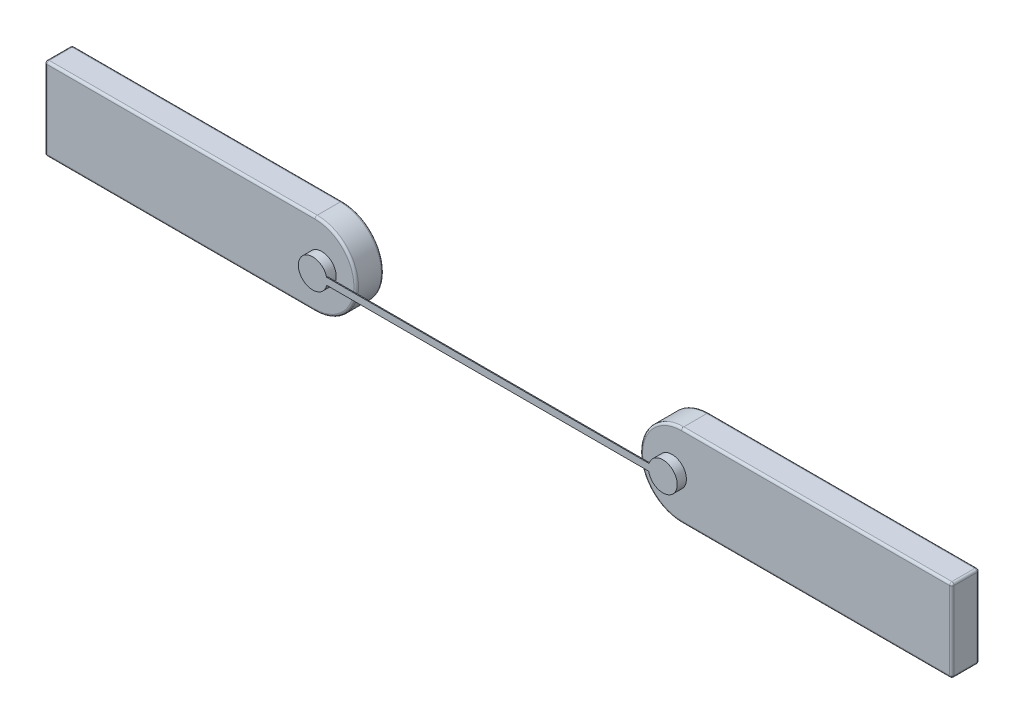
ISO-10303-21;
HEADER;
FILE_DESCRIPTION(('STEP AP214'),'2;1');
FILE_NAME('part.step','',(''),(''),'','','');
FILE_SCHEMA(('AUTOMOTIVE_DESIGN { 1 0 10303 214 1 1 1 1 }'));
ENDSEC;
DATA;
#1=APPLICATION_CONTEXT('core data for automotive mechanical design processes');
#2=APPLICATION_PROTOCOL_DEFINITION('international standard','automotive_design',2000,#1);
#3=PRODUCT_CONTEXT('',#1,'mechanical');
#4=PRODUCT('Part','Part','',(#3));
#5=PRODUCT_RELATED_PRODUCT_CATEGORY('part','',(#4));
#6=PRODUCT_DEFINITION_FORMATION('','',#4);
#7=PRODUCT_DEFINITION_CONTEXT('part definition',#1,'design');
#8=PRODUCT_DEFINITION('design','',#6,#7);
#9=PRODUCT_DEFINITION_SHAPE('','',#8);
#10=(LENGTH_UNIT() NAMED_UNIT(*) SI_UNIT(.MILLI.,.METRE.));
#11=(NAMED_UNIT(*) PLANE_ANGLE_UNIT() SI_UNIT($,.RADIAN.));
#12=(NAMED_UNIT(*) SI_UNIT($,.STERADIAN.) SOLID_ANGLE_UNIT());
#13=UNCERTAINTY_MEASURE_WITH_UNIT(LENGTH_MEASURE(1.E-05),#10,'distance_accuracy_value','');
#14=(GEOMETRIC_REPRESENTATION_CONTEXT(3) GLOBAL_UNCERTAINTY_ASSIGNED_CONTEXT((#13)) GLOBAL_UNIT_ASSIGNED_CONTEXT((#10,
#11,#12)) REPRESENTATION_CONTEXT('',''));
#15=CARTESIAN_POINT('',(0.,0.,0.));
#16=DIRECTION('',(0.,0.,1.));
#17=DIRECTION('',(1.,0.,0.));
#18=AXIS2_PLACEMENT_3D('',#15,#16,#17);
#19=CARTESIAN_POINT('',(-4.925,0.425,0.025));
#20=DIRECTION('',(1.,0.,0.));
#21=DIRECTION('',(0.,0.,-1.));
#22=AXIS2_PLACEMENT_3D('',#19,#20,#21);
#23=SPHERICAL_SURFACE('',#22,0.0250000000000003);
#24=CARTESIAN_POINT('',(-4.925,0.425,0.025));
#25=DIRECTION('',(-1.,0.,0.));
#26=DIRECTION('',(0.,0.,1.));
#27=AXIS2_PLACEMENT_3D('',#24,#25,#26);
#28=CIRCLE('',#27,0.025);
#29=CARTESIAN_POINT('',(-4.925,0.425,0.));
#30=VERTEX_POINT('',#29);
#31=CARTESIAN_POINT('',(-4.925,0.45,0.025));
#32=VERTEX_POINT('',#31);
#33=EDGE_CURVE('E109',#30,#32,#28,.F.);
#34=ORIENTED_EDGE('',*,*,#33,.F.);
#35=CARTESIAN_POINT('',(-4.925,0.425,0.025));
#36=DIRECTION('',(0.,-1.,0.));
#37=DIRECTION('',(0.,0.,-1.));
#38=AXIS2_PLACEMENT_3D('',#35,#36,#37);
#39=CIRCLE('',#38,0.025);
#40=CARTESIAN_POINT('',(-4.95,0.425,0.025));
#41=VERTEX_POINT('',#40);
#42=EDGE_CURVE('E113',#41,#30,#39,.T.);
#43=ORIENTED_EDGE('',*,*,#42,.F.);
#44=CARTESIAN_POINT('',(-4.925,0.425,0.025));
#45=DIRECTION('',(0.,0.,-1.));
#46=DIRECTION('',(-1.,0.,0.));
#47=AXIS2_PLACEMENT_3D('',#44,#45,#46);
#48=CIRCLE('',#47,0.025);
#49=EDGE_CURVE('E137',#32,#41,#48,.F.);
#50=ORIENTED_EDGE('',*,*,#49,.F.);
#51=EDGE_LOOP('',(#34,#43,#50));
#52=FACE_BOUND('',#51,.T.);
#53=ADVANCED_FACE('F17',(#52),#23,.T.);
#54=CARTESIAN_POINT('',(-3.338292000825,0.,0.));
#55=DIRECTION('',(0.,0.,1.));
#56=DIRECTION('',(1.,0.,0.));
#57=AXIS2_PLACEMENT_3D('',#54,#55,#56);
#58=PLANE('',#57);
#59=CARTESIAN_POINT('',(-2.,0.,0.));
#60=DIRECTION('',(0.,0.,1.));
#61=DIRECTION('',(1.,0.,0.));
#62=AXIS2_PLACEMENT_3D('',#59,#60,#61);
#63=CIRCLE('',#62,0.425);
#64=CARTESIAN_POINT('',(-2.,-0.425,0.));
#65=VERTEX_POINT('',#64);
#66=CARTESIAN_POINT('',(-2.,0.425,0.));
#67=VERTEX_POINT('',#66);
#68=EDGE_CURVE('E21',#65,#67,#63,.T.);
#69=ORIENTED_EDGE('',*,*,#68,.F.);
#70=DIRECTION('',(1.,0.,0.));
#71=VECTOR('',#70,1.);
#72=CARTESIAN_POINT('',(-3.406646000412,-0.425,0.));
#73=LINE('',#72,#71);
#74=CARTESIAN_POINT('',(-4.925,-0.425,0.));
#75=VERTEX_POINT('',#74);
#76=EDGE_CURVE('E120',#75,#65,#73,.T.);
#77=ORIENTED_EDGE('',*,*,#76,.F.);
#78=DIRECTION('',(0.,-1.,0.));
#79=VECTOR('',#78,1.);
#80=CARTESIAN_POINT('',(-4.925,0.,0.));
#81=LINE('',#80,#79);
#82=EDGE_CURVE('E116',#30,#75,#81,.T.);
#83=ORIENTED_EDGE('',*,*,#82,.F.);
#84=DIRECTION('',(-1.,0.,0.));
#85=VECTOR('',#84,1.);
#86=CARTESIAN_POINT('',(-3.406646000412,0.425,0.));
#87=LINE('',#86,#85);
#88=EDGE_CURVE('E103',#67,#30,#87,.T.);
#89=ORIENTED_EDGE('',*,*,#88,.F.);
#90=EDGE_LOOP('',(#69,#77,#83,#89));
#91=FACE_BOUND('',#90,.T.);
#92=ADVANCED_FACE('F118',(#91),#58,.F.);
#93=CARTESIAN_POINT('',(-4.925,-0.425,0.025));
#94=DIRECTION('',(1.,0.,0.));
#95=DIRECTION('',(0.,-1.,0.));
#96=AXIS2_PLACEMENT_3D('',#93,#94,#95);
#97=SPHERICAL_SURFACE('',#96,0.0250000000000004);
#98=CARTESIAN_POINT('',(-4.925,-0.425,0.025));
#99=DIRECTION('',(0.,-1.,0.));
#100=DIRECTION('',(0.,0.,-1.));
#101=AXIS2_PLACEMENT_3D('',#98,#99,#100);
#102=CIRCLE('',#101,0.025);
#103=CARTESIAN_POINT('',(-4.95,-0.425,0.025));
#104=VERTEX_POINT('',#103);
#105=EDGE_CURVE('E124',#75,#104,#102,.F.);
#106=ORIENTED_EDGE('',*,*,#105,.F.);
#107=CARTESIAN_POINT('',(-4.925,-0.425,0.025));
#108=DIRECTION('',(1.,0.,0.));
#109=DIRECTION('',(0.,0.,-1.));
#110=AXIS2_PLACEMENT_3D('',#107,#108,#109);
#111=CIRCLE('',#110,0.025);
#112=CARTESIAN_POINT('',(-4.925,-0.45,0.025));
#113=VERTEX_POINT('',#112);
#114=EDGE_CURVE('E148',#113,#75,#111,.T.);
#115=ORIENTED_EDGE('',*,*,#114,.F.);
#116=CARTESIAN_POINT('',(-4.925,-0.425,0.025));
#117=DIRECTION('',(0.,0.,-1.));
#118=DIRECTION('',(-1.,0.,0.));
#119=AXIS2_PLACEMENT_3D('',#116,#117,#118);
#120=CIRCLE('',#119,0.025);
#121=EDGE_CURVE('E286',#104,#113,#120,.F.);
#122=ORIENTED_EDGE('',*,*,#121,.F.);
#123=EDGE_LOOP('',(#106,#115,#122));
#124=FACE_BOUND('',#123,.T.);
#125=ADVANCED_FACE('F1074',(#124),#97,.T.);
#126=CARTESIAN_POINT('',(-2.,0.,0.025));
#127=DIRECTION('',(0.,0.,1.));
#128=DIRECTION('',(1.,0.,0.));
#129=AXIS2_PLACEMENT_3D('',#126,#127,#128);
#130=TOROIDAL_SURFACE('',#129,0.425,0.0249999999999998);
#131=ORIENTED_EDGE('',*,*,#68,.T.);
#132=CARTESIAN_POINT('',(-2.,0.425,0.025));
#133=DIRECTION('',(-1.,0.,0.));
#134=DIRECTION('',(0.,0.,1.));
#135=AXIS2_PLACEMENT_3D('',#132,#133,#134);
#136=CIRCLE('',#135,0.025);
#137=CARTESIAN_POINT('',(-2.,0.45,0.025));
#138=VERTEX_POINT('',#137);
#139=EDGE_CURVE('E111',#138,#67,#136,.T.);
#140=ORIENTED_EDGE('',*,*,#139,.F.);
#141=CARTESIAN_POINT('',(-2.,0.,0.025));
#142=DIRECTION('',(0.,0.,-1.));
#143=DIRECTION('',(-1.,0.,0.));
#144=AXIS2_PLACEMENT_3D('',#141,#142,#143);
#145=CIRCLE('',#144,0.45);
#146=CARTESIAN_POINT('',(-2.,-0.45,0.025));
#147=VERTEX_POINT('',#146);
#148=EDGE_CURVE('E289',#147,#138,#145,.F.);
#149=ORIENTED_EDGE('',*,*,#148,.F.);
#150=CARTESIAN_POINT('',(-2.,-0.425,0.025));
#151=DIRECTION('',(1.,0.,0.));
#152=DIRECTION('',(0.,0.,-1.));
#153=AXIS2_PLACEMENT_3D('',#150,#151,#152);
#154=CIRCLE('',#153,0.025);
#155=EDGE_CURVE('E147',#65,#147,#154,.F.);
#156=ORIENTED_EDGE('',*,*,#155,.F.);
#157=EDGE_LOOP('',(#131,#140,#149,#156));
#158=FACE_BOUND('',#157,.T.);
#159=ADVANCED_FACE('F1065',(#158),#130,.T.);
#160=CARTESIAN_POINT('',(-3.406646000412,0.425,0.025));
#161=DIRECTION('',(-1.,0.,0.));
#162=DIRECTION('',(0.,0.,1.));
#163=AXIS2_PLACEMENT_3D('',#160,#161,#162);
#164=CYLINDRICAL_SURFACE('',#163,0.025);
#165=ORIENTED_EDGE('',*,*,#139,.T.);
#166=ORIENTED_EDGE('',*,*,#88,.T.);
#167=ORIENTED_EDGE('',*,*,#33,.T.);
#168=DIRECTION('',(1.,0.,0.));
#169=VECTOR('',#168,1.);
#170=CARTESIAN_POINT('',(-3.475,0.45,0.025));
#171=LINE('',#170,#169);
#172=EDGE_CURVE('E283',#138,#32,#171,.F.);
#173=ORIENTED_EDGE('',*,*,#172,.F.);
#174=EDGE_LOOP('',(#165,#166,#167,#173));
#175=FACE_BOUND('',#174,.T.);
#176=ADVANCED_FACE('F105',(#175),#164,.T.);
#177=CARTESIAN_POINT('',(-4.925,0.,0.025));
#178=DIRECTION('',(0.,-1.,0.));
#179=DIRECTION('',(0.,0.,-1.));
#180=AXIS2_PLACEMENT_3D('',#177,#178,#179);
#181=CYLINDRICAL_SURFACE('',#180,0.025);
#182=ORIENTED_EDGE('',*,*,#105,.T.);
#183=DIRECTION('',(0.,1.,0.));
#184=VECTOR('',#183,1.);
#185=CARTESIAN_POINT('',(-4.95,0.,0.025));
#186=LINE('',#185,#184);
#187=EDGE_CURVE('E131',#41,#104,#186,.F.);
#188=ORIENTED_EDGE('',*,*,#187,.F.);
#189=ORIENTED_EDGE('',*,*,#42,.T.);
#190=ORIENTED_EDGE('',*,*,#82,.T.);
#191=EDGE_LOOP('',(#182,#188,#189,#190));
#192=FACE_BOUND('',#191,.T.);
#193=ADVANCED_FACE('F128',(#192),#181,.T.);
#194=CARTESIAN_POINT('',(-4.925,0.425,0.3));
#195=DIRECTION('',(0.,0.,-1.));
#196=DIRECTION('',(-1.,0.,0.));
#197=AXIS2_PLACEMENT_3D('',#194,#195,#196);
#198=CYLINDRICAL_SURFACE('',#197,0.025);
#199=ORIENTED_EDGE('',*,*,#49,.T.);
#200=DIRECTION('',(0.,0.,1.));
#201=VECTOR('',#200,1.);
#202=CARTESIAN_POINT('',(-4.95,0.425,0.3));
#203=LINE('',#202,#201);
#204=CARTESIAN_POINT('',(-4.95,0.425,0.275));
#205=VERTEX_POINT('',#204);
#206=EDGE_CURVE('E247',#205,#41,#203,.F.);
#207=ORIENTED_EDGE('',*,*,#206,.F.);
#208=CARTESIAN_POINT('',(-4.925,0.425,0.275));
#209=DIRECTION('',(0.,0.,1.));
#210=DIRECTION('',(1.,0.,0.));
#211=AXIS2_PLACEMENT_3D('',#208,#209,#210);
#212=CIRCLE('',#211,0.0250000000000004);
#213=CARTESIAN_POINT('',(-4.925,0.45,0.275));
#214=VERTEX_POINT('',#213);
#215=EDGE_CURVE('E262',#214,#205,#212,.T.);
#216=ORIENTED_EDGE('',*,*,#215,.F.);
#217=DIRECTION('',(0.,0.,1.));
#218=VECTOR('',#217,1.);
#219=CARTESIAN_POINT('',(-4.925,0.45,0.3));
#220=LINE('',#219,#218);
#221=EDGE_CURVE('E274',#32,#214,#220,.T.);
#222=ORIENTED_EDGE('',*,*,#221,.F.);
#223=EDGE_LOOP('',(#199,#207,#216,#222));
#224=FACE_BOUND('',#223,.T.);
#225=ADVANCED_FACE('F1038',(#224),#198,.T.);
#226=CARTESIAN_POINT('',(-3.406646000412,-0.425,0.025));
#227=DIRECTION('',(1.,0.,0.));
#228=DIRECTION('',(0.,0.,-1.));
#229=AXIS2_PLACEMENT_3D('',#226,#227,#228);
#230=CYLINDRICAL_SURFACE('',#229,0.025);
#231=ORIENTED_EDGE('',*,*,#155,.T.);
#232=DIRECTION('',(1.,0.,0.));
#233=VECTOR('',#232,1.);
#234=CARTESIAN_POINT('',(-3.475,-0.45,0.025));
#235=LINE('',#234,#233);
#236=EDGE_CURVE('E237',#113,#147,#235,.T.);
#237=ORIENTED_EDGE('',*,*,#236,.F.);
#238=ORIENTED_EDGE('',*,*,#114,.T.);
#239=ORIENTED_EDGE('',*,*,#76,.T.);
#240=EDGE_LOOP('',(#231,#237,#238,#239));
#241=FACE_BOUND('',#240,.T.);
#242=ADVANCED_FACE('F1028',(#241),#230,.T.);
#243=CARTESIAN_POINT('',(-4.925,-0.425,0.3));
#244=DIRECTION('',(0.,0.,-1.));
#245=DIRECTION('',(-1.,0.,0.));
#246=AXIS2_PLACEMENT_3D('',#243,#244,#245);
#247=CYLINDRICAL_SURFACE('',#246,0.025);
#248=ORIENTED_EDGE('',*,*,#121,.T.);
#249=DIRECTION('',(0.,0.,-1.));
#250=VECTOR('',#249,1.);
#251=CARTESIAN_POINT('',(-4.925,-0.45,0.3));
#252=LINE('',#251,#250);
#253=CARTESIAN_POINT('',(-4.925,-0.45,0.275));
#254=VERTEX_POINT('',#253);
#255=EDGE_CURVE('E236',#254,#113,#252,.T.);
#256=ORIENTED_EDGE('',*,*,#255,.F.);
#257=CARTESIAN_POINT('',(-4.925,-0.425,0.275));
#258=DIRECTION('',(0.,0.,1.));
#259=DIRECTION('',(1.,0.,0.));
#260=AXIS2_PLACEMENT_3D('',#257,#258,#259);
#261=CIRCLE('',#260,0.0250000000000004);
#262=CARTESIAN_POINT('',(-4.95,-0.425,0.275));
#263=VERTEX_POINT('',#262);
#264=EDGE_CURVE('E244',#263,#254,#261,.T.);
#265=ORIENTED_EDGE('',*,*,#264,.F.);
#266=DIRECTION('',(0.,0.,1.));
#267=VECTOR('',#266,1.);
#268=CARTESIAN_POINT('',(-4.95,-0.425,0.3));
#269=LINE('',#268,#267);
#270=EDGE_CURVE('E254',#104,#263,#269,.T.);
#271=ORIENTED_EDGE('',*,*,#270,.F.);
#272=EDGE_LOOP('',(#248,#256,#265,#271));
#273=FACE_BOUND('',#272,.T.);
#274=ADVANCED_FACE('F1019',(#273),#247,.T.);
#275=CARTESIAN_POINT('',(-2.,0.,0.3));
#276=DIRECTION('',(0.,0.,-1.));
#277=DIRECTION('',(-1.,0.,0.));
#278=AXIS2_PLACEMENT_3D('',#275,#276,#277);
#279=CYLINDRICAL_SURFACE('',#278,0.45);
#280=CARTESIAN_POINT('',(-2.,0.,0.275));
#281=DIRECTION('',(0.,0.,1.));
#282=DIRECTION('',(1.,0.,0.));
#283=AXIS2_PLACEMENT_3D('',#280,#281,#282);
#284=CIRCLE('',#283,0.45);
#285=CARTESIAN_POINT('',(-2.,-0.45,0.275));
#286=VERTEX_POINT('',#285);
#287=CARTESIAN_POINT('',(-2.,0.45,0.275));
#288=VERTEX_POINT('',#287);
#289=EDGE_CURVE('E228',#286,#288,#284,.T.);
#290=ORIENTED_EDGE('',*,*,#289,.F.);
#291=DIRECTION('',(0.,0.,-1.));
#292=VECTOR('',#291,1.);
#293=CARTESIAN_POINT('',(-2.,-0.45,0.3));
#294=LINE('',#293,#292);
#295=EDGE_CURVE('E233',#147,#286,#294,.F.);
#296=ORIENTED_EDGE('',*,*,#295,.F.);
#297=ORIENTED_EDGE('',*,*,#148,.T.);
#298=DIRECTION('',(0.,0.,1.));
#299=VECTOR('',#298,1.);
#300=CARTESIAN_POINT('',(-2.,0.45,0.3));
#301=LINE('',#300,#299);
#302=EDGE_CURVE('E265',#288,#138,#301,.F.);
#303=ORIENTED_EDGE('',*,*,#302,.F.);
#304=EDGE_LOOP('',(#290,#296,#297,#303));
#305=FACE_BOUND('',#304,.T.);
#306=ADVANCED_FACE('F1010',(#305),#279,.T.);
#307=CARTESIAN_POINT('',(-3.475,0.45,0.3));
#308=DIRECTION('',(0.,1.,0.));
#309=DIRECTION('',(0.,0.,1.));
#310=AXIS2_PLACEMENT_3D('',#307,#308,#309);
#311=PLANE('',#310);
#312=DIRECTION('',(-1.,0.,0.));
#313=VECTOR('',#312,1.);
#314=CARTESIAN_POINT('',(-3.406646000412,0.45,0.275));
#315=LINE('',#314,#313);
#316=EDGE_CURVE('E217',#288,#214,#315,.T.);
#317=ORIENTED_EDGE('',*,*,#316,.F.);
#318=ORIENTED_EDGE('',*,*,#302,.T.);
#319=ORIENTED_EDGE('',*,*,#172,.T.);
#320=ORIENTED_EDGE('',*,*,#221,.T.);
#321=EDGE_LOOP('',(#317,#318,#319,#320));
#322=FACE_BOUND('',#321,.T.);
#323=ADVANCED_FACE('F322',(#322),#311,.T.);
#324=CARTESIAN_POINT('',(-4.925,0.425,0.275));
#325=DIRECTION('',(1.,0.,0.));
#326=DIRECTION('',(0.,1.,0.));
#327=AXIS2_PLACEMENT_3D('',#324,#325,#326);
#328=SPHERICAL_SURFACE('',#327,0.0250000000000004);
#329=CARTESIAN_POINT('',(-4.925,0.425,0.275));
#330=DIRECTION('',(-1.,0.,0.));
#331=DIRECTION('',(0.,0.,1.));
#332=AXIS2_PLACEMENT_3D('',#329,#330,#331);
#333=CIRCLE('',#332,0.025);
#334=CARTESIAN_POINT('',(-4.925,0.425,0.3));
#335=VERTEX_POINT('',#334);
#336=EDGE_CURVE('E223',#214,#335,#333,.F.);
#337=ORIENTED_EDGE('',*,*,#336,.F.);
#338=ORIENTED_EDGE('',*,*,#215,.T.);
#339=CARTESIAN_POINT('',(-4.925,0.425,0.275));
#340=DIRECTION('',(0.,-1.,0.));
#341=DIRECTION('',(0.,0.,-1.));
#342=AXIS2_PLACEMENT_3D('',#339,#340,#341);
#343=CIRCLE('',#342,0.025);
#344=EDGE_CURVE('E214',#335,#205,#343,.T.);
#345=ORIENTED_EDGE('',*,*,#344,.F.);
#346=EDGE_LOOP('',(#337,#338,#345));
#347=FACE_BOUND('',#346,.T.);
#348=ADVANCED_FACE('F600',(#347),#328,.T.);
#349=CARTESIAN_POINT('',(-4.95,0.,0.3));
#350=DIRECTION('',(-1.,0.,0.));
#351=DIRECTION('',(0.,0.,1.));
#352=AXIS2_PLACEMENT_3D('',#349,#350,#351);
#353=PLANE('',#352);
#354=DIRECTION('',(0.,-1.,0.));
#355=VECTOR('',#354,1.);
#356=CARTESIAN_POINT('',(-4.95,0.,0.275));
#357=LINE('',#356,#355);
#358=EDGE_CURVE('E211',#205,#263,#357,.T.);
#359=ORIENTED_EDGE('',*,*,#358,.F.);
#360=ORIENTED_EDGE('',*,*,#206,.T.);
#361=ORIENTED_EDGE('',*,*,#187,.T.);
#362=ORIENTED_EDGE('',*,*,#270,.T.);
#363=EDGE_LOOP('',(#359,#360,#361,#362));
#364=FACE_BOUND('',#363,.T.);
#365=ADVANCED_FACE('F984',(#364),#353,.T.);
#366=CARTESIAN_POINT('',(-4.925,-0.425,0.275));
#367=DIRECTION('',(1.,0.,0.));
#368=DIRECTION('',(0.,0.,1.));
#369=AXIS2_PLACEMENT_3D('',#366,#367,#368);
#370=SPHERICAL_SURFACE('',#369,0.0250000000000003);
#371=ORIENTED_EDGE('',*,*,#264,.T.);
#372=CARTESIAN_POINT('',(-4.925,-0.425,0.275));
#373=DIRECTION('',(1.,0.,0.));
#374=DIRECTION('',(0.,0.,-1.));
#375=AXIS2_PLACEMENT_3D('',#372,#373,#374);
#376=CIRCLE('',#375,0.025);
#377=CARTESIAN_POINT('',(-4.925,-0.425,0.3));
#378=VERTEX_POINT('',#377);
#379=EDGE_CURVE('E190',#378,#254,#376,.T.);
#380=ORIENTED_EDGE('',*,*,#379,.F.);
#381=CARTESIAN_POINT('',(-4.925,-0.425,0.275));
#382=DIRECTION('',(0.,-1.,0.));
#383=DIRECTION('',(0.,0.,-1.));
#384=AXIS2_PLACEMENT_3D('',#381,#382,#383);
#385=CIRCLE('',#384,0.025);
#386=EDGE_CURVE('E200',#263,#378,#385,.F.);
#387=ORIENTED_EDGE('',*,*,#386,.F.);
#388=EDGE_LOOP('',(#371,#380,#387));
#389=FACE_BOUND('',#388,.T.);
#390=ADVANCED_FACE('F608',(#389),#370,.T.);
#391=CARTESIAN_POINT('',(-3.475,-0.45,0.3));
#392=DIRECTION('',(0.,-1.,0.));
#393=DIRECTION('',(0.,0.,-1.));
#394=AXIS2_PLACEMENT_3D('',#391,#392,#393);
#395=PLANE('',#394);
#396=DIRECTION('',(1.,0.,0.));
#397=VECTOR('',#396,1.);
#398=CARTESIAN_POINT('',(-3.406646000412,-0.45,0.275));
#399=LINE('',#398,#397);
#400=EDGE_CURVE('E183',#254,#286,#399,.T.);
#401=ORIENTED_EDGE('',*,*,#400,.F.);
#402=ORIENTED_EDGE('',*,*,#255,.T.);
#403=ORIENTED_EDGE('',*,*,#236,.T.);
#404=ORIENTED_EDGE('',*,*,#295,.T.);
#405=EDGE_LOOP('',(#401,#402,#403,#404));
#406=FACE_BOUND('',#405,.T.);
#407=ADVANCED_FACE('F965',(#406),#395,.T.);
#408=CARTESIAN_POINT('',(-2.,0.,0.275));
#409=DIRECTION('',(0.,0.,-1.));
#410=DIRECTION('',(-1.,0.,0.));
#411=AXIS2_PLACEMENT_3D('',#408,#409,#410);
#412=TOROIDAL_SURFACE('',#411,0.425,0.0250000000000001);
#413=CARTESIAN_POINT('',(-2.,0.425,0.275));
#414=DIRECTION('',(-1.,0.,0.));
#415=DIRECTION('',(0.,0.,1.));
#416=AXIS2_PLACEMENT_3D('',#413,#414,#415);
#417=CIRCLE('',#416,0.025);
#418=CARTESIAN_POINT('',(-2.,0.425,0.3));
#419=VERTEX_POINT('',#418);
#420=EDGE_CURVE('E220',#419,#288,#417,.T.);
#421=ORIENTED_EDGE('',*,*,#420,.F.);
#422=CARTESIAN_POINT('',(-2.,0.,0.3));
#423=DIRECTION('',(0.,0.,-1.));
#424=DIRECTION('',(-1.,0.,0.));
#425=AXIS2_PLACEMENT_3D('',#422,#423,#424);
#426=CIRCLE('',#425,0.425);
#427=CARTESIAN_POINT('',(-2.,-0.425,0.3));
#428=VERTEX_POINT('',#427);
#429=EDGE_CURVE('E172',#428,#419,#426,.F.);
#430=ORIENTED_EDGE('',*,*,#429,.F.);
#431=CARTESIAN_POINT('',(-2.,-0.425,0.275));
#432=DIRECTION('',(1.,0.,0.));
#433=DIRECTION('',(0.,0.,-1.));
#434=AXIS2_PLACEMENT_3D('',#431,#432,#433);
#435=CIRCLE('',#434,0.025);
#436=EDGE_CURVE('E178',#286,#428,#435,.F.);
#437=ORIENTED_EDGE('',*,*,#436,.F.);
#438=ORIENTED_EDGE('',*,*,#289,.T.);
#439=EDGE_LOOP('',(#421,#430,#437,#438));
#440=FACE_BOUND('',#439,.T.);
#441=ADVANCED_FACE('F956',(#440),#412,.T.);
#442=CARTESIAN_POINT('',(-3.406646000412,0.425,0.275));
#443=DIRECTION('',(-1.,0.,0.));
#444=DIRECTION('',(0.,0.,1.));
#445=AXIS2_PLACEMENT_3D('',#442,#443,#444);
#446=CYLINDRICAL_SURFACE('',#445,0.025);
#447=ORIENTED_EDGE('',*,*,#420,.T.);
#448=ORIENTED_EDGE('',*,*,#316,.T.);
#449=ORIENTED_EDGE('',*,*,#336,.T.);
#450=DIRECTION('',(1.,0.,0.));
#451=VECTOR('',#450,1.);
#452=CARTESIAN_POINT('',(-3.338292000825,0.425,0.3));
#453=LINE('',#452,#451);
#454=EDGE_CURVE('E174',#419,#335,#453,.F.);
#455=ORIENTED_EDGE('',*,*,#454,.F.);
#456=EDGE_LOOP('',(#447,#448,#449,#455));
#457=FACE_BOUND('',#456,.T.);
#458=ADVANCED_FACE('F621',(#457),#446,.T.);
#459=CARTESIAN_POINT('',(-4.925,0.,0.275));
#460=DIRECTION('',(0.,-1.,0.));
#461=DIRECTION('',(0.,0.,-1.));
#462=AXIS2_PLACEMENT_3D('',#459,#460,#461);
#463=CYLINDRICAL_SURFACE('',#462,0.025);
#464=ORIENTED_EDGE('',*,*,#386,.T.);
#465=DIRECTION('',(0.,1.,0.));
#466=VECTOR('',#465,1.);
#467=CARTESIAN_POINT('',(-4.925,0.,0.3));
#468=LINE('',#467,#466);
#469=EDGE_CURVE('E203',#335,#378,#468,.F.);
#470=ORIENTED_EDGE('',*,*,#469,.F.);
#471=ORIENTED_EDGE('',*,*,#344,.T.);
#472=ORIENTED_EDGE('',*,*,#358,.T.);
#473=EDGE_LOOP('',(#464,#470,#471,#472));
#474=FACE_BOUND('',#473,.T.);
#475=ADVANCED_FACE('F603',(#474),#463,.T.);
#476=CARTESIAN_POINT('',(-3.406646000412,-0.425,0.275));
#477=DIRECTION('',(1.,0.,0.));
#478=DIRECTION('',(0.,0.,-1.));
#479=AXIS2_PLACEMENT_3D('',#476,#477,#478);
#480=CYLINDRICAL_SURFACE('',#479,0.025);
#481=ORIENTED_EDGE('',*,*,#436,.T.);
#482=DIRECTION('',(1.,0.,0.));
#483=VECTOR('',#482,1.);
#484=CARTESIAN_POINT('',(-3.338292000825,-0.425,0.3));
#485=LINE('',#484,#483);
#486=EDGE_CURVE('E206',#378,#428,#485,.T.);
#487=ORIENTED_EDGE('',*,*,#486,.F.);
#488=ORIENTED_EDGE('',*,*,#379,.T.);
#489=ORIENTED_EDGE('',*,*,#400,.T.);
#490=EDGE_LOOP('',(#481,#487,#488,#489));
#491=FACE_BOUND('',#490,.T.);
#492=ADVANCED_FACE('F610',(#491),#480,.T.);
#493=CARTESIAN_POINT('',(-0.007182508707047,0.001620585098863,0.39));
#494=DIRECTION('',(0.,0.,1.));
#495=DIRECTION('',(0.,-1.,0.));
#496=AXIS2_PLACEMENT_3D('',#493,#494,#495);
#497=PLANE('',#496);
#498=CARTESIAN_POINT('',(1.896202862263,-0.007182582630776,0.39));
#499=DIRECTION('',(0.,0.,1.));
#500=DIRECTION('',(0.,-1.,0.));
#501=AXIS2_PLACEMENT_3D('',#498,#499,#500);
#502=CIRCLE('',#501,0.156888040569);
#503=CARTESIAN_POINT('',(1.74196789471575,-0.03591291606426,0.39));
#504=VERTEX_POINT('',#503);
#505=CARTESIAN_POINT('',(1.74631366855805,0.03915408626199,0.39));
#506=VERTEX_POINT('',#505);
#507=EDGE_CURVE('E175',#504,#506,#502,.F.);
#508=ORIENTED_EDGE('',*,*,#507,.F.);
#509=DIRECTION('',(1.,0.,0.));
#510=VECTOR('',#509,1.);
#511=CARTESIAN_POINT('',(-0.007182508707047,-0.03591291606426,0.39));
#512=LINE('',#511,#510);
#513=CARTESIAN_POINT('',(-1.77221098252384,-0.0359129160642781,0.39));
#514=VERTEX_POINT('',#513);
#515=EDGE_CURVE('E579',#514,#504,#512,.T.);
#516=ORIENTED_EDGE('',*,*,#515,.F.);
#517=CARTESIAN_POINT('',(-1.924933344126,0.,0.39));
#518=DIRECTION('',(0.,0.,1.));
#519=DIRECTION('',(0.,-1.,0.));
#520=AXIS2_PLACEMENT_3D('',#517,#518,#519);
#521=CIRCLE('',#520,0.156888040569);
#522=CARTESIAN_POINT('',(-1.7730096303662,0.0391540862619655,0.39));
#523=VERTEX_POINT('',#522);
#524=EDGE_CURVE('E177',#523,#514,#521,.F.);
#525=ORIENTED_EDGE('',*,*,#524,.F.);
#526=DIRECTION('',(1.,0.,0.));
#527=VECTOR('',#526,1.);
#528=CARTESIAN_POINT('',(-0.007182508707047,0.03915408626199,0.39));
#529=LINE('',#528,#527);
#530=EDGE_CURVE('E171',#506,#523,#529,.F.);
#531=ORIENTED_EDGE('',*,*,#530,.F.);
#532=EDGE_LOOP('',(#508,#516,#525,#531));
#533=FACE_BOUND('',#532,.T.);
#534=ADVANCED_FACE('F612',(#533),#497,.F.);
#535=CARTESIAN_POINT('',(-3.338292000825,0.,0.3));
#536=DIRECTION('',(0.,0.,1.));
#537=DIRECTION('',(1.,0.,0.));
#538=AXIS2_PLACEMENT_3D('',#535,#536,#537);
#539=PLANE('',#538);
#540=CARTESIAN_POINT('',(-1.924933344126,0.,0.3));
#541=DIRECTION('',(0.,0.,1.));
#542=DIRECTION('',(0.,-1.,0.));
#543=AXIS2_PLACEMENT_3D('',#540,#541,#542);
#544=CIRCLE('',#543,0.156888040569);
#545=CARTESIAN_POINT('',(-1.924933344126,-0.156888040569,0.3));
#546=VERTEX_POINT('',#545);
#547=EDGE_CURVE('E167',#546,#546,#544,.T.);
#548=ORIENTED_EDGE('',*,*,#547,.F.);
#549=EDGE_LOOP('',(#548));
#550=FACE_BOUND('',#549,.T.);
#551=ORIENTED_EDGE('',*,*,#469,.T.);
#552=ORIENTED_EDGE('',*,*,#486,.T.);
#553=ORIENTED_EDGE('',*,*,#429,.T.);
#554=ORIENTED_EDGE('',*,*,#454,.T.);
#555=EDGE_LOOP('',(#551,#552,#553,#554));
#556=FACE_BOUND('',#555,.T.);
#557=ADVANCED_FACE('F593',(#550,#556),#539,.T.);
#558=CARTESIAN_POINT('',(-0.007182508707047,-0.03591291606426,0.4));
#559=DIRECTION('',(0.,-1.,0.));
#560=DIRECTION('',(0.,0.,-1.));
#561=AXIS2_PLACEMENT_3D('',#558,#559,#560);
#562=PLANE('',#561);
#563=DIRECTION('',(0.,0.,1.));
#564=VECTOR('',#563,1.);
#565=CARTESIAN_POINT('',(-1.77221098252385,-0.0359129160642962,0.3));
#566=LINE('',#565,#564);
#567=CARTESIAN_POINT('',(-1.77221098252384,-0.0359129160642781,0.4));
#568=VERTEX_POINT('',#567);
#569=EDGE_CURVE('E574',#514,#568,#566,.T.);
#570=ORIENTED_EDGE('',*,*,#569,.F.);
#571=ORIENTED_EDGE('',*,*,#515,.T.);
#572=DIRECTION('',(0.,0.,-1.));
#573=VECTOR('',#572,1.);
#574=CARTESIAN_POINT('',(1.741967894716,-0.03591291606426,0.4));
#575=LINE('',#574,#573);
#576=CARTESIAN_POINT('',(1.74196789471575,-0.03591291606426,0.4));
#577=VERTEX_POINT('',#576);
#578=EDGE_CURVE('E580',#504,#577,#575,.F.);
#579=ORIENTED_EDGE('',*,*,#578,.T.);
#580=DIRECTION('',(1.,0.,0.));
#581=VECTOR('',#580,1.);
#582=CARTESIAN_POINT('',(-1.924933344126,-0.03591291606426,0.4));
#583=LINE('',#582,#581);
#584=EDGE_CURVE('E571',#568,#577,#583,.T.);
#585=ORIENTED_EDGE('',*,*,#584,.F.);
#586=EDGE_LOOP('',(#570,#571,#579,#585));
#587=FACE_BOUND('',#586,.T.);
#588=ADVANCED_FACE('F695',(#587),#562,.T.);
#589=CARTESIAN_POINT('',(-0.007182508707047,0.03915408626199,0.4));
#590=DIRECTION('',(0.,1.,0.));
#591=DIRECTION('',(0.,0.,1.));
#592=AXIS2_PLACEMENT_3D('',#589,#590,#591);
#593=PLANE('',#592);
#594=DIRECTION('',(0.,0.,1.));
#595=VECTOR('',#594,1.);
#596=CARTESIAN_POINT('',(-1.77300963036619,0.039154086261941,0.3));
#597=LINE('',#596,#595);
#598=CARTESIAN_POINT('',(-1.7730096303662,0.0391540862619655,0.4));
#599=VERTEX_POINT('',#598);
#600=EDGE_CURVE('E170',#599,#523,#597,.F.);
#601=ORIENTED_EDGE('',*,*,#600,.F.);
#602=DIRECTION('',(1.,0.,0.));
#603=VECTOR('',#602,1.);
#604=CARTESIAN_POINT('',(-1.924933344126,0.03915408626199,0.4));
#605=LINE('',#604,#603);
#606=CARTESIAN_POINT('',(1.74631366855805,0.03915408626199,0.4));
#607=VERTEX_POINT('',#606);
#608=EDGE_CURVE('E166',#607,#599,#605,.F.);
#609=ORIENTED_EDGE('',*,*,#608,.F.);
#610=DIRECTION('',(0.,0.,1.));
#611=VECTOR('',#610,1.);
#612=CARTESIAN_POINT('',(1.746313668558,0.03915408626199,0.4));
#613=LINE('',#612,#611);
#614=EDGE_CURVE('E577',#607,#506,#613,.F.);
#615=ORIENTED_EDGE('',*,*,#614,.T.);
#616=ORIENTED_EDGE('',*,*,#530,.T.);
#617=EDGE_LOOP('',(#601,#609,#615,#616));
#618=FACE_BOUND('',#617,.T.);
#619=ADVANCED_FACE('F692',(#618),#593,.T.);
#620=CARTESIAN_POINT('',(-1.924933344126,0.,0.3));
#621=DIRECTION('',(0.,0.,1.));
#622=DIRECTION('',(0.,-1.,0.));
#623=AXIS2_PLACEMENT_3D('',#620,#621,#622);
#624=CYLINDRICAL_SURFACE('',#623,0.156888040569);
#625=CARTESIAN_POINT('',(-1.924933344126,0.,0.4));
#626=DIRECTION('',(0.,0.,1.));
#627=DIRECTION('',(0.,-1.,0.));
#628=AXIS2_PLACEMENT_3D('',#625,#626,#627);
#629=CIRCLE('',#628,0.156888040569);
#630=EDGE_CURVE('E163',#599,#568,#629,.T.);
#631=ORIENTED_EDGE('',*,*,#630,.F.);
#632=ORIENTED_EDGE('',*,*,#600,.T.);
#633=ORIENTED_EDGE('',*,*,#524,.T.);
#634=ORIENTED_EDGE('',*,*,#569,.T.);
#635=EDGE_LOOP('',(#631,#632,#633,#634));
#636=FACE_BOUND('',#635,.T.);
#637=ORIENTED_EDGE('',*,*,#547,.T.);
#638=EDGE_LOOP('',(#637));
#639=FACE_BOUND('',#638,.T.);
#640=ADVANCED_FACE('F688',(#636,#639),#624,.T.);
#641=CARTESIAN_POINT('',(-1.924933344126,0.,0.4));
#642=DIRECTION('',(0.,0.,1.));
#643=DIRECTION('',(1.,0.,0.));
#644=AXIS2_PLACEMENT_3D('',#641,#642,#643);
#645=PLANE('',#644);
#646=ORIENTED_EDGE('',*,*,#608,.T.);
#647=ORIENTED_EDGE('',*,*,#630,.T.);
#648=ORIENTED_EDGE('',*,*,#584,.T.);
#649=CARTESIAN_POINT('',(1.896202862263,-0.007182582630776,0.4));
#650=DIRECTION('',(0.,0.,1.));
#651=DIRECTION('',(0.,-1.,0.));
#652=AXIS2_PLACEMENT_3D('',#649,#650,#651);
#653=CIRCLE('',#652,0.156888040569);
#654=EDGE_CURVE('E161',#607,#577,#653,.F.);
#655=ORIENTED_EDGE('',*,*,#654,.F.);
#656=EDGE_LOOP('',(#646,#647,#648,#655));
#657=FACE_BOUND('',#656,.T.);
#658=ADVANCED_FACE('F684',(#657),#645,.T.);
#659=CARTESIAN_POINT('',(1.896202862263,-0.007182582630776,0.3));
#660=DIRECTION('',(0.,0.,1.));
#661=DIRECTION('',(0.,-1.,0.));
#662=AXIS2_PLACEMENT_3D('',#659,#660,#661);
#663=CYLINDRICAL_SURFACE('',#662,0.156888040569);
#664=ORIENTED_EDGE('',*,*,#614,.F.);
#665=ORIENTED_EDGE('',*,*,#654,.T.);
#666=ORIENTED_EDGE('',*,*,#578,.F.);
#667=ORIENTED_EDGE('',*,*,#507,.T.);
#668=EDGE_LOOP('',(#664,#665,#666,#667));
#669=FACE_BOUND('',#668,.T.);
#670=CARTESIAN_POINT('',(1.896202862263,-0.007182582630776,0.3));
#671=DIRECTION('',(0.,0.,1.));
#672=DIRECTION('',(0.,-1.,0.));
#673=AXIS2_PLACEMENT_3D('',#670,#671,#672);
#674=CIRCLE('',#673,0.156888040569);
#675=CARTESIAN_POINT('',(1.896202862263,-0.164070623199776,0.3));
#676=VERTEX_POINT('',#675);
#677=EDGE_CURVE('E155',#676,#676,#674,.F.);
#678=ORIENTED_EDGE('',*,*,#677,.F.);
#679=EDGE_LOOP('',(#678));
#680=FACE_BOUND('',#679,.T.);
#681=ADVANCED_FACE('F681',(#669,#680),#663,.T.);
#682=CARTESIAN_POINT('',(4.925,-0.425,0.275));
#683=DIRECTION('',(1.,0.,0.));
#684=DIRECTION('',(0.,0.,-1.));
#685=AXIS2_PLACEMENT_3D('',#682,#683,#684);
#686=SPHERICAL_SURFACE('',#685,0.0250000000000003);
#687=CARTESIAN_POINT('',(4.925,-0.425,0.275));
#688=DIRECTION('',(-1.,0.,0.));
#689=DIRECTION('',(0.,0.,1.));
#690=AXIS2_PLACEMENT_3D('',#687,#688,#689);
#691=CIRCLE('',#690,0.025);
#692=CARTESIAN_POINT('',(4.925,-0.45,0.275));
#693=VERTEX_POINT('',#692);
#694=CARTESIAN_POINT('',(4.925,-0.425,0.3));
#695=VERTEX_POINT('',#694);
#696=EDGE_CURVE('E158',#693,#695,#691,.T.);
#697=ORIENTED_EDGE('',*,*,#696,.F.);
#698=CARTESIAN_POINT('',(4.925,-0.425,0.275));
#699=DIRECTION('',(0.,0.,-1.));
#700=DIRECTION('',(-1.,0.,0.));
#701=AXIS2_PLACEMENT_3D('',#698,#699,#700);
#702=CIRCLE('',#701,0.025);
#703=CARTESIAN_POINT('',(4.95,-0.425,0.275));
#704=VERTEX_POINT('',#703);
#705=EDGE_CURVE('E534',#704,#693,#702,.T.);
#706=ORIENTED_EDGE('',*,*,#705,.F.);
#707=CARTESIAN_POINT('',(4.925,-0.425,0.275));
#708=DIRECTION('',(0.,-1.,0.));
#709=DIRECTION('',(0.,0.,-1.));
#710=AXIS2_PLACEMENT_3D('',#707,#708,#709);
#711=CIRCLE('',#710,0.025);
#712=EDGE_CURVE('E538',#695,#704,#711,.F.);
#713=ORIENTED_EDGE('',*,*,#712,.F.);
#714=EDGE_LOOP('',(#697,#706,#713));
#715=FACE_BOUND('',#714,.T.);
#716=ADVANCED_FACE('F679',(#715),#686,.T.);
#717=CARTESIAN_POINT('',(3.338292000825,0.,0.3));
#718=DIRECTION('',(0.,0.,1.));
#719=DIRECTION('',(1.,0.,0.));
#720=AXIS2_PLACEMENT_3D('',#717,#718,#719);
#721=PLANE('',#720);
#722=ORIENTED_EDGE('',*,*,#677,.T.);
#723=EDGE_LOOP('',(#722));
#724=FACE_BOUND('',#723,.T.);
#725=DIRECTION('',(1.,0.,0.));
#726=VECTOR('',#725,1.);
#727=CARTESIAN_POINT('',(3.406646000412,0.425,0.3));
#728=LINE('',#727,#726);
#729=CARTESIAN_POINT('',(2.,0.425,0.3));
#730=VERTEX_POINT('',#729);
#731=CARTESIAN_POINT('',(4.925,0.425,0.3));
#732=VERTEX_POINT('',#731);
#733=EDGE_CURVE('E529',#730,#732,#728,.T.);
#734=ORIENTED_EDGE('',*,*,#733,.F.);
#735=CARTESIAN_POINT('',(2.,0.,0.3));
#736=DIRECTION('',(0.,0.,-1.));
#737=DIRECTION('',(-1.,0.,0.));
#738=AXIS2_PLACEMENT_3D('',#735,#736,#737);
#739=CIRCLE('',#738,0.425);
#740=CARTESIAN_POINT('',(2.,-0.425,0.3));
#741=VERTEX_POINT('',#740);
#742=EDGE_CURVE('E159',#730,#741,#739,.F.);
#743=ORIENTED_EDGE('',*,*,#742,.T.);
#744=DIRECTION('',(-1.,0.,0.));
#745=VECTOR('',#744,1.);
#746=CARTESIAN_POINT('',(3.406646000412,-0.425,0.3));
#747=LINE('',#746,#745);
#748=EDGE_CURVE('E551',#695,#741,#747,.T.);
#749=ORIENTED_EDGE('',*,*,#748,.F.);
#750=DIRECTION('',(0.,-1.,0.));
#751=VECTOR('',#750,1.);
#752=CARTESIAN_POINT('',(4.925,0.,0.3));
#753=LINE('',#752,#751);
#754=EDGE_CURVE('E546',#732,#695,#753,.T.);
#755=ORIENTED_EDGE('',*,*,#754,.F.);
#756=EDGE_LOOP('',(#734,#743,#749,#755));
#757=FACE_BOUND('',#756,.T.);
#758=ADVANCED_FACE('F676',(#724,#757),#721,.T.);
#759=CARTESIAN_POINT('',(4.925,0.425,0.275));
#760=DIRECTION('',(1.,0.,0.));
#761=DIRECTION('',(0.,-1.,0.));
#762=AXIS2_PLACEMENT_3D('',#759,#760,#761);
#763=SPHERICAL_SURFACE('',#762,0.0250000000000004);
#764=CARTESIAN_POINT('',(4.925,0.425,0.275));
#765=DIRECTION('',(0.,-1.,0.));
#766=DIRECTION('',(0.,0.,-1.));
#767=AXIS2_PLACEMENT_3D('',#764,#765,#766);
#768=CIRCLE('',#767,0.025);
#769=CARTESIAN_POINT('',(4.95,0.425,0.275));
#770=VERTEX_POINT('',#769);
#771=EDGE_CURVE('E549',#770,#732,#768,.T.);
#772=ORIENTED_EDGE('',*,*,#771,.F.);
#773=CARTESIAN_POINT('',(4.925,0.425,0.275));
#774=DIRECTION('',(0.,0.,-1.));
#775=DIRECTION('',(-1.,0.,0.));
#776=AXIS2_PLACEMENT_3D('',#773,#774,#775);
#777=CIRCLE('',#776,0.025);
#778=CARTESIAN_POINT('',(4.925,0.45,0.275));
#779=VERTEX_POINT('',#778);
#780=EDGE_CURVE('E525',#779,#770,#777,.T.);
#781=ORIENTED_EDGE('',*,*,#780,.F.);
#782=CARTESIAN_POINT('',(4.925,0.425,0.275));
#783=DIRECTION('',(1.,0.,0.));
#784=DIRECTION('',(0.,0.,-1.));
#785=AXIS2_PLACEMENT_3D('',#782,#783,#784);
#786=CIRCLE('',#785,0.025);
#787=EDGE_CURVE('E532',#732,#779,#786,.F.);
#788=ORIENTED_EDGE('',*,*,#787,.F.);
#789=EDGE_LOOP('',(#772,#781,#788));
#790=FACE_BOUND('',#789,.T.);
#791=ADVANCED_FACE('F674',(#790),#763,.T.);
#792=CARTESIAN_POINT('',(3.406646000412,-0.425,0.275));
#793=DIRECTION('',(-1.,0.,0.));
#794=DIRECTION('',(0.,0.,1.));
#795=AXIS2_PLACEMENT_3D('',#792,#793,#794);
#796=CYLINDRICAL_SURFACE('',#795,0.025);
#797=CARTESIAN_POINT('',(2.,-0.425,0.275));
#798=DIRECTION('',(-1.,0.,0.));
#799=DIRECTION('',(0.,0.,1.));
#800=AXIS2_PLACEMENT_3D('',#797,#798,#799);
#801=CIRCLE('',#800,0.0250000000000001);
#802=CARTESIAN_POINT('',(2.,-0.45,0.275));
#803=VERTEX_POINT('',#802);
#804=EDGE_CURVE('E516',#803,#741,#801,.T.);
#805=ORIENTED_EDGE('',*,*,#804,.F.);
#806=DIRECTION('',(1.,0.,0.));
#807=VECTOR('',#806,1.);
#808=CARTESIAN_POINT('',(3.475,-0.45,0.275));
#809=LINE('',#808,#807);
#810=EDGE_CURVE('E503',#693,#803,#809,.F.);
#811=ORIENTED_EDGE('',*,*,#810,.F.);
#812=ORIENTED_EDGE('',*,*,#696,.T.);
#813=ORIENTED_EDGE('',*,*,#748,.T.);
#814=EDGE_LOOP('',(#805,#811,#812,#813));
#815=FACE_BOUND('',#814,.T.);
#816=ADVANCED_FACE('F670',(#815),#796,.T.);
#817=CARTESIAN_POINT('',(4.925,0.,0.275));
#818=DIRECTION('',(0.,-1.,0.));
#819=DIRECTION('',(0.,0.,-1.));
#820=AXIS2_PLACEMENT_3D('',#817,#818,#819);
#821=CYLINDRICAL_SURFACE('',#820,0.025);
#822=ORIENTED_EDGE('',*,*,#712,.T.);
#823=DIRECTION('',(0.,1.,0.));
#824=VECTOR('',#823,1.);
#825=CARTESIAN_POINT('',(4.95,0.,0.275));
#826=LINE('',#825,#824);
#827=EDGE_CURVE('E488',#770,#704,#826,.F.);
#828=ORIENTED_EDGE('',*,*,#827,.F.);
#829=ORIENTED_EDGE('',*,*,#771,.T.);
#830=ORIENTED_EDGE('',*,*,#754,.T.);
#831=EDGE_LOOP('',(#822,#828,#829,#830));
#832=FACE_BOUND('',#831,.T.);
#833=ADVANCED_FACE('F666',(#832),#821,.T.);
#834=CARTESIAN_POINT('',(4.925,-0.425,0.3));
#835=DIRECTION('',(0.,0.,-1.));
#836=DIRECTION('',(-1.,0.,0.));
#837=AXIS2_PLACEMENT_3D('',#834,#835,#836);
#838=CYLINDRICAL_SURFACE('',#837,0.025);
#839=CARTESIAN_POINT('',(4.925,-0.425,0.025));
#840=DIRECTION('',(0.,0.,-1.));
#841=DIRECTION('',(-1.,0.,0.));
#842=AXIS2_PLACEMENT_3D('',#839,#840,#841);
#843=CIRCLE('',#842,0.0250000000000004);
#844=CARTESIAN_POINT('',(4.95,-0.425,0.025));
#845=VERTEX_POINT('',#844);
#846=CARTESIAN_POINT('',(4.925,-0.45,0.025));
#847=VERTEX_POINT('',#846);
#848=EDGE_CURVE('E411',#845,#847,#843,.T.);
#849=ORIENTED_EDGE('',*,*,#848,.F.);
#850=DIRECTION('',(0.,0.,-1.));
#851=VECTOR('',#850,1.);
#852=CARTESIAN_POINT('',(4.95,-0.425,0.3));
#853=LINE('',#852,#851);
#854=EDGE_CURVE('E482',#704,#845,#853,.T.);
#855=ORIENTED_EDGE('',*,*,#854,.F.);
#856=ORIENTED_EDGE('',*,*,#705,.T.);
#857=DIRECTION('',(0.,0.,-1.));
#858=VECTOR('',#857,1.);
#859=CARTESIAN_POINT('',(4.925,-0.45,0.3));
#860=LINE('',#859,#858);
#861=EDGE_CURVE('E495',#847,#693,#860,.F.);
#862=ORIENTED_EDGE('',*,*,#861,.F.);
#863=EDGE_LOOP('',(#849,#855,#856,#862));
#864=FACE_BOUND('',#863,.T.);
#865=ADVANCED_FACE('F662',(#864),#838,.T.);
#866=CARTESIAN_POINT('',(3.406646000412,0.425,0.275));
#867=DIRECTION('',(1.,0.,0.));
#868=DIRECTION('',(0.,0.,-1.));
#869=AXIS2_PLACEMENT_3D('',#866,#867,#868);
#870=CYLINDRICAL_SURFACE('',#869,0.025);
#871=CARTESIAN_POINT('',(2.,0.425,0.275));
#872=DIRECTION('',(-1.,0.,0.));
#873=DIRECTION('',(0.,0.,1.));
#874=AXIS2_PLACEMENT_3D('',#871,#872,#873);
#875=CIRCLE('',#874,0.0250000000000001);
#876=CARTESIAN_POINT('',(2.,0.45,0.275));
#877=VERTEX_POINT('',#876);
#878=EDGE_CURVE('E514',#730,#877,#875,.T.);
#879=ORIENTED_EDGE('',*,*,#878,.F.);
#880=ORIENTED_EDGE('',*,*,#733,.T.);
#881=ORIENTED_EDGE('',*,*,#787,.T.);
#882=DIRECTION('',(1.,0.,0.));
#883=VECTOR('',#882,1.);
#884=CARTESIAN_POINT('',(3.475,0.45,0.275));
#885=LINE('',#884,#883);
#886=EDGE_CURVE('E477',#877,#779,#885,.T.);
#887=ORIENTED_EDGE('',*,*,#886,.F.);
#888=EDGE_LOOP('',(#879,#880,#881,#887));
#889=FACE_BOUND('',#888,.T.);
#890=ADVANCED_FACE('F658',(#889),#870,.T.);
#891=CARTESIAN_POINT('',(4.925,0.425,0.3));
#892=DIRECTION('',(0.,0.,-1.));
#893=DIRECTION('',(-1.,0.,0.));
#894=AXIS2_PLACEMENT_3D('',#891,#892,#893);
#895=CYLINDRICAL_SURFACE('',#894,0.025);
#896=CARTESIAN_POINT('',(4.925,0.425,0.025));
#897=DIRECTION('',(0.,0.,-1.));
#898=DIRECTION('',(-1.,0.,0.));
#899=AXIS2_PLACEMENT_3D('',#896,#897,#898);
#900=CIRCLE('',#899,0.0250000000000004);
#901=CARTESIAN_POINT('',(4.925,0.45,0.025));
#902=VERTEX_POINT('',#901);
#903=CARTESIAN_POINT('',(4.95,0.425,0.025));
#904=VERTEX_POINT('',#903);
#905=EDGE_CURVE('E480',#902,#904,#900,.T.);
#906=ORIENTED_EDGE('',*,*,#905,.F.);
#907=DIRECTION('',(0.,0.,1.));
#908=VECTOR('',#907,1.);
#909=CARTESIAN_POINT('',(4.925,0.45,0.3));
#910=LINE('',#909,#908);
#911=EDGE_CURVE('E470',#779,#902,#910,.F.);
#912=ORIENTED_EDGE('',*,*,#911,.F.);
#913=ORIENTED_EDGE('',*,*,#780,.T.);
#914=DIRECTION('',(0.,0.,-1.));
#915=VECTOR('',#914,1.);
#916=CARTESIAN_POINT('',(4.95,0.425,0.3));
#917=LINE('',#916,#915);
#918=EDGE_CURVE('E485',#904,#770,#917,.F.);
#919=ORIENTED_EDGE('',*,*,#918,.F.);
#920=EDGE_LOOP('',(#906,#912,#913,#919));
#921=FACE_BOUND('',#920,.T.);
#922=ADVANCED_FACE('F655',(#921),#895,.T.);
#923=CARTESIAN_POINT('',(2.,0.,0.275));
#924=DIRECTION('',(0.,0.,-1.));
#925=DIRECTION('',(-1.,0.,0.));
#926=AXIS2_PLACEMENT_3D('',#923,#924,#925);
#927=TOROIDAL_SURFACE('',#926,0.425,0.0250000000000001);
#928=CARTESIAN_POINT('',(2.,0.,0.275));
#929=DIRECTION('',(0.,0.,-1.));
#930=DIRECTION('',(-1.,0.,0.));
#931=AXIS2_PLACEMENT_3D('',#928,#929,#930);
#932=CIRCLE('',#931,0.45);
#933=EDGE_CURVE('E464',#803,#877,#932,.T.);
#934=ORIENTED_EDGE('',*,*,#933,.F.);
#935=ORIENTED_EDGE('',*,*,#804,.T.);
#936=ORIENTED_EDGE('',*,*,#742,.F.);
#937=ORIENTED_EDGE('',*,*,#878,.T.);
#938=EDGE_LOOP('',(#934,#935,#936,#937));
#939=FACE_BOUND('',#938,.T.);
#940=ADVANCED_FACE('F653',(#939),#927,.T.);
#941=CARTESIAN_POINT('',(3.475,-0.45,0.3));
#942=DIRECTION('',(0.,-1.,0.));
#943=DIRECTION('',(0.,0.,-1.));
#944=AXIS2_PLACEMENT_3D('',#941,#942,#943);
#945=PLANE('',#944);
#946=DIRECTION('',(1.,0.,0.));
#947=VECTOR('',#946,1.);
#948=CARTESIAN_POINT('',(3.406646000412,-0.45,0.025));
#949=LINE('',#948,#947);
#950=CARTESIAN_POINT('',(2.,-0.45,0.025));
#951=VERTEX_POINT('',#950);
#952=EDGE_CURVE('E405',#847,#951,#949,.F.);
#953=ORIENTED_EDGE('',*,*,#952,.F.);
#954=ORIENTED_EDGE('',*,*,#861,.T.);
#955=ORIENTED_EDGE('',*,*,#810,.T.);
#956=DIRECTION('',(0.,0.,-1.));
#957=VECTOR('',#956,1.);
#958=CARTESIAN_POINT('',(2.,-0.45,0.3));
#959=LINE('',#958,#957);
#960=EDGE_CURVE('E467',#951,#803,#959,.F.);
#961=ORIENTED_EDGE('',*,*,#960,.F.);
#962=EDGE_LOOP('',(#953,#954,#955,#961));
#963=FACE_BOUND('',#962,.T.);
#964=ADVANCED_FACE('F650',(#963),#945,.T.);
#965=CARTESIAN_POINT('',(4.925,-0.425,0.025));
#966=DIRECTION('',(1.,0.,0.));
#967=DIRECTION('',(0.,1.,0.));
#968=AXIS2_PLACEMENT_3D('',#965,#966,#967);
#969=SPHERICAL_SURFACE('',#968,0.0250000000000004);
#970=CARTESIAN_POINT('',(4.925,-0.425,0.025));
#971=DIRECTION('',(1.,0.,0.));
#972=DIRECTION('',(0.,0.,-1.));
#973=AXIS2_PLACEMENT_3D('',#970,#971,#972);
#974=CIRCLE('',#973,0.025);
#975=CARTESIAN_POINT('',(4.925,-0.425,0.));
#976=VERTEX_POINT('',#975);
#977=EDGE_CURVE('E408',#976,#847,#974,.F.);
#978=ORIENTED_EDGE('',*,*,#977,.F.);
#979=CARTESIAN_POINT('',(4.925,-0.425,0.025));
#980=DIRECTION('',(0.,1.,0.));
#981=DIRECTION('',(0.,0.,1.));
#982=AXIS2_PLACEMENT_3D('',#979,#980,#981);
#983=CIRCLE('',#982,0.025);
#984=EDGE_CURVE('E395',#845,#976,#983,.T.);
#985=ORIENTED_EDGE('',*,*,#984,.F.);
#986=ORIENTED_EDGE('',*,*,#848,.T.);
#987=EDGE_LOOP('',(#978,#985,#986));
#988=FACE_BOUND('',#987,.T.);
#989=ADVANCED_FACE('F409',(#988),#969,.T.);
#990=CARTESIAN_POINT('',(4.95,0.,0.3));
#991=DIRECTION('',(1.,0.,0.));
#992=DIRECTION('',(0.,0.,-1.));
#993=AXIS2_PLACEMENT_3D('',#990,#991,#992);
#994=PLANE('',#993);
#995=ORIENTED_EDGE('',*,*,#827,.T.);
#996=ORIENTED_EDGE('',*,*,#854,.T.);
#997=DIRECTION('',(0.,1.,0.));
#998=VECTOR('',#997,1.);
#999=CARTESIAN_POINT('',(4.95,0.,0.025));
#1000=LINE('',#999,#998);
#1001=EDGE_CURVE('E402',#904,#845,#1000,.F.);
#1002=ORIENTED_EDGE('',*,*,#1001,.F.);
#1003=ORIENTED_EDGE('',*,*,#918,.T.);
#1004=EDGE_LOOP('',(#995,#996,#1002,#1003));
#1005=FACE_BOUND('',#1004,.T.);
#1006=ADVANCED_FACE('F646',(#1005),#994,.T.);
#1007=CARTESIAN_POINT('',(4.925,0.425,0.025));
#1008=DIRECTION('',(1.,0.,0.));
#1009=DIRECTION('',(0.,0.,1.));
#1010=AXIS2_PLACEMENT_3D('',#1007,#1008,#1009);
#1011=SPHERICAL_SURFACE('',#1010,0.0250000000000003);
#1012=CARTESIAN_POINT('',(4.925,0.425,0.025));
#1013=DIRECTION('',(0.,1.,0.));
#1014=DIRECTION('',(0.,0.,1.));
#1015=AXIS2_PLACEMENT_3D('',#1012,#1013,#1014);
#1016=CIRCLE('',#1015,0.025);
#1017=CARTESIAN_POINT('',(4.925,0.425,0.));
#1018=VERTEX_POINT('',#1017);
#1019=EDGE_CURVE('E404',#1018,#904,#1016,.F.);
#1020=ORIENTED_EDGE('',*,*,#1019,.F.);
#1021=CARTESIAN_POINT('',(4.925,0.425,0.025));
#1022=DIRECTION('',(-1.,0.,0.));
#1023=DIRECTION('',(0.,0.,1.));
#1024=AXIS2_PLACEMENT_3D('',#1021,#1022,#1023);
#1025=CIRCLE('',#1024,0.025);
#1026=EDGE_CURVE('E443',#902,#1018,#1025,.T.);
#1027=ORIENTED_EDGE('',*,*,#1026,.F.);
#1028=ORIENTED_EDGE('',*,*,#905,.T.);
#1029=EDGE_LOOP('',(#1020,#1027,#1028));
#1030=FACE_BOUND('',#1029,.T.);
#1031=ADVANCED_FACE('F644',(#1030),#1011,.T.);
#1032=CARTESIAN_POINT('',(3.475,0.45,0.3));
#1033=DIRECTION('',(0.,1.,0.));
#1034=DIRECTION('',(0.,0.,1.));
#1035=AXIS2_PLACEMENT_3D('',#1032,#1033,#1034);
#1036=PLANE('',#1035);
#1037=DIRECTION('',(-1.,0.,0.));
#1038=VECTOR('',#1037,1.);
#1039=CARTESIAN_POINT('',(3.406646000412,0.45,0.025));
#1040=LINE('',#1039,#1038);
#1041=CARTESIAN_POINT('',(2.,0.45,0.025));
#1042=VERTEX_POINT('',#1041);
#1043=EDGE_CURVE('E440',#1042,#902,#1040,.F.);
#1044=ORIENTED_EDGE('',*,*,#1043,.F.);
#1045=DIRECTION('',(0.,0.,-1.));
#1046=VECTOR('',#1045,1.);
#1047=CARTESIAN_POINT('',(2.,0.45,0.3));
#1048=LINE('',#1047,#1046);
#1049=EDGE_CURVE('E416',#877,#1042,#1048,.T.);
#1050=ORIENTED_EDGE('',*,*,#1049,.F.);
#1051=ORIENTED_EDGE('',*,*,#886,.T.);
#1052=ORIENTED_EDGE('',*,*,#911,.T.);
#1053=EDGE_LOOP('',(#1044,#1050,#1051,#1052));
#1054=FACE_BOUND('',#1053,.T.);
#1055=ADVANCED_FACE('F640',(#1054),#1036,.T.);
#1056=CARTESIAN_POINT('',(2.,0.,0.3));
#1057=DIRECTION('',(0.,0.,-1.));
#1058=DIRECTION('',(-1.,0.,0.));
#1059=AXIS2_PLACEMENT_3D('',#1056,#1057,#1058);
#1060=CYLINDRICAL_SURFACE('',#1059,0.45);
#1061=ORIENTED_EDGE('',*,*,#1049,.T.);
#1062=CARTESIAN_POINT('',(2.,0.,0.025));
#1063=DIRECTION('',(0.,0.,-1.));
#1064=DIRECTION('',(-1.,0.,0.));
#1065=AXIS2_PLACEMENT_3D('',#1062,#1063,#1064);
#1066=CIRCLE('',#1065,0.45);
#1067=EDGE_CURVE('E429',#951,#1042,#1066,.T.);
#1068=ORIENTED_EDGE('',*,*,#1067,.F.);
#1069=ORIENTED_EDGE('',*,*,#960,.T.);
#1070=ORIENTED_EDGE('',*,*,#933,.T.);
#1071=EDGE_LOOP('',(#1061,#1068,#1069,#1070));
#1072=FACE_BOUND('',#1071,.T.);
#1073=ADVANCED_FACE('F637',(#1072),#1060,.T.);
#1074=CARTESIAN_POINT('',(3.406646000412,-0.425,0.025));
#1075=DIRECTION('',(1.,0.,0.));
#1076=DIRECTION('',(0.,0.,-1.));
#1077=AXIS2_PLACEMENT_3D('',#1074,#1075,#1076);
#1078=CYLINDRICAL_SURFACE('',#1077,0.025);
#1079=CARTESIAN_POINT('',(2.,-0.425,0.0250000000000001));
#1080=DIRECTION('',(-1.,0.,0.));
#1081=DIRECTION('',(0.,0.,1.));
#1082=AXIS2_PLACEMENT_3D('',#1079,#1080,#1081);
#1083=CIRCLE('',#1082,0.0249999999999999);
#1084=CARTESIAN_POINT('',(2.,-0.425,0.));
#1085=VERTEX_POINT('',#1084);
#1086=EDGE_CURVE('E427',#1085,#951,#1083,.T.);
#1087=ORIENTED_EDGE('',*,*,#1086,.F.);
#1088=DIRECTION('',(1.,0.,0.));
#1089=VECTOR('',#1088,1.);
#1090=CARTESIAN_POINT('',(3.338292000825,-0.425,0.));
#1091=LINE('',#1090,#1089);
#1092=EDGE_CURVE('E421',#1085,#976,#1091,.T.);
#1093=ORIENTED_EDGE('',*,*,#1092,.T.);
#1094=ORIENTED_EDGE('',*,*,#977,.T.);
#1095=ORIENTED_EDGE('',*,*,#952,.T.);
#1096=EDGE_LOOP('',(#1087,#1093,#1094,#1095));
#1097=FACE_BOUND('',#1096,.T.);
#1098=ADVANCED_FACE('F425',(#1097),#1078,.T.);
#1099=CARTESIAN_POINT('',(4.925,0.,0.025));
#1100=DIRECTION('',(0.,1.,0.));
#1101=DIRECTION('',(0.,0.,1.));
#1102=AXIS2_PLACEMENT_3D('',#1099,#1100,#1101);
#1103=CYLINDRICAL_SURFACE('',#1102,0.025);
#1104=ORIENTED_EDGE('',*,*,#1019,.T.);
#1105=ORIENTED_EDGE('',*,*,#1001,.T.);
#1106=ORIENTED_EDGE('',*,*,#984,.T.);
#1107=DIRECTION('',(0.,1.,0.));
#1108=VECTOR('',#1107,1.);
#1109=CARTESIAN_POINT('',(4.925,0.,0.));
#1110=LINE('',#1109,#1108);
#1111=EDGE_CURVE('E400',#976,#1018,#1110,.T.);
#1112=ORIENTED_EDGE('',*,*,#1111,.T.);
#1113=EDGE_LOOP('',(#1104,#1105,#1106,#1112));
#1114=FACE_BOUND('',#1113,.T.);
#1115=ADVANCED_FACE('F398',(#1114),#1103,.T.);
#1116=CARTESIAN_POINT('',(3.406646000412,0.425,0.025));
#1117=DIRECTION('',(-1.,0.,0.));
#1118=DIRECTION('',(0.,0.,1.));
#1119=AXIS2_PLACEMENT_3D('',#1116,#1117,#1118);
#1120=CYLINDRICAL_SURFACE('',#1119,0.025);
#1121=CARTESIAN_POINT('',(2.,0.425,0.0250000000000001));
#1122=DIRECTION('',(-1.,0.,0.));
#1123=DIRECTION('',(0.,0.,1.));
#1124=AXIS2_PLACEMENT_3D('',#1121,#1122,#1123);
#1125=CIRCLE('',#1124,0.0249999999999999);
#1126=CARTESIAN_POINT('',(2.,0.425,0.));
#1127=VERTEX_POINT('',#1126);
#1128=EDGE_CURVE('E35',#1042,#1127,#1125,.T.);
#1129=ORIENTED_EDGE('',*,*,#1128,.F.);
#1130=ORIENTED_EDGE('',*,*,#1043,.T.);
#1131=ORIENTED_EDGE('',*,*,#1026,.T.);
#1132=DIRECTION('',(1.,0.,0.));
#1133=VECTOR('',#1132,1.);
#1134=CARTESIAN_POINT('',(3.338292000825,0.425,0.));
#1135=LINE('',#1134,#1133);
#1136=EDGE_CURVE('E27',#1018,#1127,#1135,.F.);
#1137=ORIENTED_EDGE('',*,*,#1136,.T.);
#1138=EDGE_LOOP('',(#1129,#1130,#1131,#1137));
#1139=FACE_BOUND('',#1138,.T.);
#1140=ADVANCED_FACE('F628',(#1139),#1120,.T.);
#1141=CARTESIAN_POINT('',(2.,0.,0.0250000000000001));
#1142=DIRECTION('',(0.,0.,1.));
#1143=DIRECTION('',(1.,0.,0.));
#1144=AXIS2_PLACEMENT_3D('',#1141,#1142,#1143);
#1145=TOROIDAL_SURFACE('',#1144,0.425,0.0249999999999999);
#1146=ORIENTED_EDGE('',*,*,#1128,.T.);
#1147=CARTESIAN_POINT('',(2.,0.,0.));
#1148=DIRECTION('',(0.,0.,1.));
#1149=DIRECTION('',(1.,0.,0.));
#1150=AXIS2_PLACEMENT_3D('',#1147,#1148,#1149);
#1151=CIRCLE('',#1150,0.425);
#1152=EDGE_CURVE('E11',#1127,#1085,#1151,.T.);
#1153=ORIENTED_EDGE('',*,*,#1152,.T.);
#1154=ORIENTED_EDGE('',*,*,#1086,.T.);
#1155=ORIENTED_EDGE('',*,*,#1067,.T.);
#1156=EDGE_LOOP('',(#1146,#1153,#1154,#1155));
#1157=FACE_BOUND('',#1156,.T.);
#1158=ADVANCED_FACE('F19',(#1157),#1145,.T.);
#1159=CARTESIAN_POINT('',(3.338292000825,0.,0.));
#1160=DIRECTION('',(0.,0.,1.));
#1161=DIRECTION('',(1.,0.,0.));
#1162=AXIS2_PLACEMENT_3D('',#1159,#1160,#1161);
#1163=PLANE('',#1162);
#1164=ORIENTED_EDGE('',*,*,#1136,.F.);
#1165=ORIENTED_EDGE('',*,*,#1111,.F.);
#1166=ORIENTED_EDGE('',*,*,#1092,.F.);
#1167=ORIENTED_EDGE('',*,*,#1152,.F.);
#1168=EDGE_LOOP('',(#1164,#1165,#1166,#1167));
#1169=FACE_BOUND('',#1168,.T.);
#1170=ADVANCED_FACE('F420',(#1169),#1163,.F.);
#1171=CLOSED_SHELL('',(#53,#92,#125,#159,#176,#193,#225,#242,#274,#306,#323,#348,#365,#390,#407,
#441,#458,#475,#492,#534,#557,#588,#619,#640,#658,#681,#716,#758,#791,#816,#833,#865,#890,#922,
#940,#964,#989,#1006,#1031,#1055,#1073,#1098,#1115,#1140,#1158,#1170));
#1172=MANIFOLD_SOLID_BREP('B1',#1171);
#1173=ADVANCED_BREP_SHAPE_REPRESENTATION('',(#18,#1172),#14);
#1174=SHAPE_DEFINITION_REPRESENTATION(#9,#1173);
ENDSEC;
END-ISO-10303-21;
